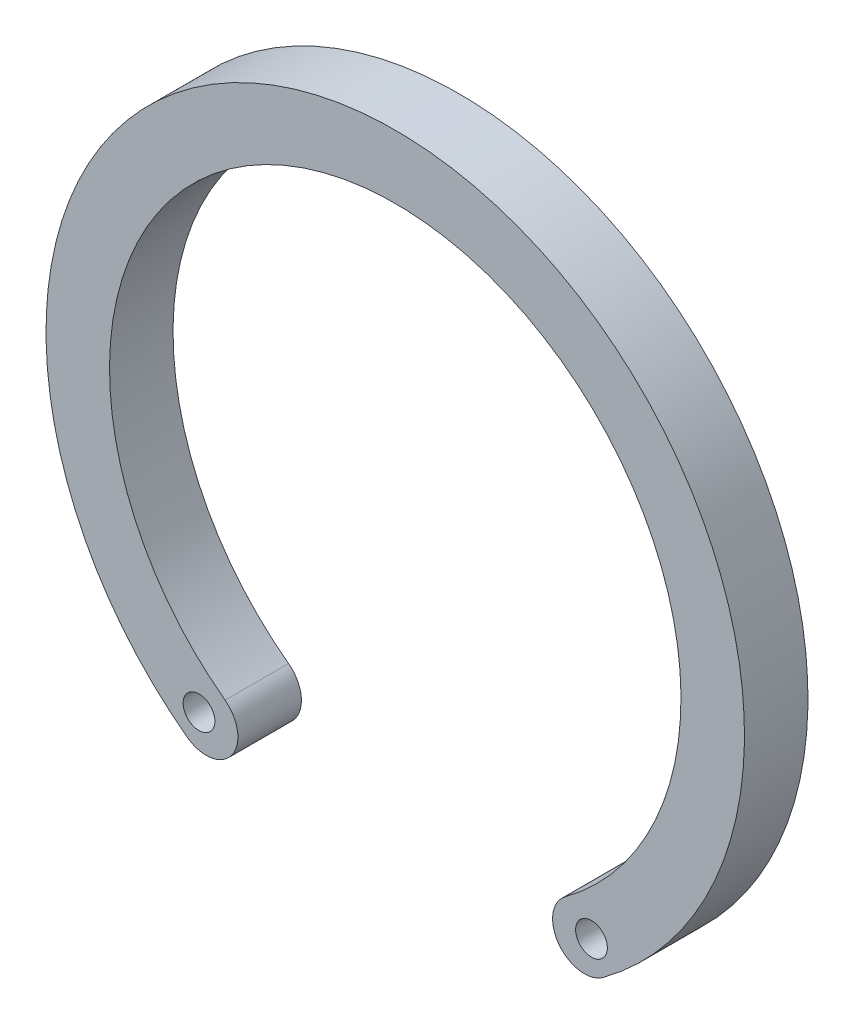
ISO-10303-21;
HEADER;
FILE_DESCRIPTION(('STEP AP214'),'2;1');
FILE_NAME('part.step','',(''),(''),'','','');
FILE_SCHEMA(('AUTOMOTIVE_DESIGN { 1 0 10303 214 1 1 1 1 }'));
ENDSEC;
DATA;
#1=APPLICATION_CONTEXT('core data for automotive mechanical design processes');
#2=APPLICATION_PROTOCOL_DEFINITION('international standard','automotive_design',2000,#1);
#3=PRODUCT_CONTEXT('',#1,'mechanical');
#4=PRODUCT('Part','Part','',(#3));
#5=PRODUCT_RELATED_PRODUCT_CATEGORY('part','',(#4));
#6=PRODUCT_DEFINITION_FORMATION('','',#4);
#7=PRODUCT_DEFINITION_CONTEXT('part definition',#1,'design');
#8=PRODUCT_DEFINITION('design','',#6,#7);
#9=PRODUCT_DEFINITION_SHAPE('','',#8);
#10=(LENGTH_UNIT() NAMED_UNIT(*) SI_UNIT(.MILLI.,.METRE.));
#11=(NAMED_UNIT(*) PLANE_ANGLE_UNIT() SI_UNIT($,.RADIAN.));
#12=(NAMED_UNIT(*) SI_UNIT($,.STERADIAN.) SOLID_ANGLE_UNIT());
#13=UNCERTAINTY_MEASURE_WITH_UNIT(LENGTH_MEASURE(1.E-05),#10,'distance_accuracy_value','');
#14=(GEOMETRIC_REPRESENTATION_CONTEXT(3) GLOBAL_UNCERTAINTY_ASSIGNED_CONTEXT((#13)) GLOBAL_UNIT_ASSIGNED_CONTEXT((#10,
#11,#12)) REPRESENTATION_CONTEXT('',''));
#15=CARTESIAN_POINT('',(0.,0.,0.));
#16=DIRECTION('',(0.,0.,1.));
#17=DIRECTION('',(1.,0.,0.));
#18=AXIS2_PLACEMENT_3D('',#15,#16,#17);
#19=CARTESIAN_POINT('',(-2.97779363616322,-4.01655885808062,1.));
#20=DIRECTION('',(0.,0.,-1.));
#21=DIRECTION('',(-1.,0.,0.));
#22=AXIS2_PLACEMENT_3D('',#19,#20,#21);
#23=CYLINDRICAL_SURFACE('',#22,0.5);
#24=CARTESIAN_POINT('',(-2.97779363616322,-4.01655885808062,0.));
#25=DIRECTION('',(0.,0.,1.));
#26=DIRECTION('',(1.,0.,0.));
#27=AXIS2_PLACEMENT_3D('',#24,#25,#26);
#28=CIRCLE('',#27,0.5);
#29=CARTESIAN_POINT('',(-3.27557299977954,-4.41821474388867,0.));
#30=VERTEX_POINT('',#29);
#31=CARTESIAN_POINT('',(-2.6800142725469,-3.61490297227255,0.));
#32=VERTEX_POINT('',#31);
#33=EDGE_CURVE('E95',#30,#32,#28,.T.);
#34=ORIENTED_EDGE('',*,*,#33,.T.);
#35=DIRECTION('',(0.,0.,-1.));
#36=VECTOR('',#35,1.);
#37=CARTESIAN_POINT('',(-2.6800142725469,-3.61490297227255,1.));
#38=LINE('',#37,#36);
#39=CARTESIAN_POINT('',(-2.6800142725469,-3.61490297227255,1.));
#40=VERTEX_POINT('',#39);
#41=EDGE_CURVE('E11',#40,#32,#38,.T.);
#42=ORIENTED_EDGE('',*,*,#41,.F.);
#43=CARTESIAN_POINT('',(-2.97779363616322,-4.01655885808062,1.));
#44=DIRECTION('',(0.,0.,1.));
#45=DIRECTION('',(1.,0.,0.));
#46=AXIS2_PLACEMENT_3D('',#43,#44,#45);
#47=CIRCLE('',#46,0.5);
#48=CARTESIAN_POINT('',(-3.27557299977954,-4.41821474388867,1.));
#49=VERTEX_POINT('',#48);
#50=EDGE_CURVE('E83',#49,#40,#47,.T.);
#51=ORIENTED_EDGE('',*,*,#50,.F.);
#52=DIRECTION('',(0.,0.,-1.));
#53=VECTOR('',#52,1.);
#54=CARTESIAN_POINT('',(-3.27557299977954,-4.41821474388867,1.));
#55=LINE('',#54,#53);
#56=EDGE_CURVE('E91',#49,#30,#55,.T.);
#57=ORIENTED_EDGE('',*,*,#56,.T.);
#58=EDGE_LOOP('',(#34,#42,#51,#57));
#59=FACE_BOUND('',#58,.T.);
#60=ADVANCED_FACE('F32',(#59),#23,.T.);
#61=CARTESIAN_POINT('',(0.,0.,1.));
#62=DIRECTION('',(0.,0.,-1.));
#63=DIRECTION('',(-1.,0.,0.));
#64=AXIS2_PLACEMENT_3D('',#61,#62,#63);
#65=CYLINDRICAL_SURFACE('',#64,4.5);
#66=CARTESIAN_POINT('',(0.,0.,0.));
#67=DIRECTION('',(0.,0.,-1.));
#68=DIRECTION('',(1.,0.,0.));
#69=AXIS2_PLACEMENT_3D('',#66,#67,#68);
#70=CIRCLE('',#69,4.5);
#71=CARTESIAN_POINT('',(2.68001427254689,-3.61490297227255,0.));
#72=VERTEX_POINT('',#71);
#73=EDGE_CURVE('E87',#32,#72,#70,.T.);
#74=ORIENTED_EDGE('',*,*,#73,.T.);
#75=DIRECTION('',(0.,0.,-1.));
#76=VECTOR('',#75,1.);
#77=CARTESIAN_POINT('',(2.68001427254689,-3.61490297227255,1.));
#78=LINE('',#77,#76);
#79=CARTESIAN_POINT('',(2.68001427254689,-3.61490297227255,1.));
#80=VERTEX_POINT('',#79);
#81=EDGE_CURVE('E40',#80,#72,#78,.T.);
#82=ORIENTED_EDGE('',*,*,#81,.F.);
#83=CARTESIAN_POINT('',(0.,0.,1.));
#84=DIRECTION('',(0.,0.,-1.));
#85=DIRECTION('',(1.,0.,0.));
#86=AXIS2_PLACEMENT_3D('',#83,#84,#85);
#87=CIRCLE('',#86,4.5);
#88=EDGE_CURVE('E78',#40,#80,#87,.T.);
#89=ORIENTED_EDGE('',*,*,#88,.F.);
#90=ORIENTED_EDGE('',*,*,#41,.T.);
#91=EDGE_LOOP('',(#74,#82,#89,#90));
#92=FACE_BOUND('',#91,.T.);
#93=ADVANCED_FACE('F86',(#92),#65,.F.);
#94=CARTESIAN_POINT('',(2.97779363616322,-4.01655885808061,1.));
#95=DIRECTION('',(0.,0.,-1.));
#96=DIRECTION('',(-1.,0.,0.));
#97=AXIS2_PLACEMENT_3D('',#94,#95,#96);
#98=CYLINDRICAL_SURFACE('',#97,0.499999999999999);
#99=CARTESIAN_POINT('',(2.97779363616322,-4.01655885808061,0.));
#100=DIRECTION('',(0.,0.,1.));
#101=DIRECTION('',(-1.,0.,0.));
#102=AXIS2_PLACEMENT_3D('',#99,#100,#101);
#103=CIRCLE('',#102,0.499999999999999);
#104=CARTESIAN_POINT('',(3.27557299977954,-4.41821474388867,0.));
#105=VERTEX_POINT('',#104);
#106=EDGE_CURVE('E65',#72,#105,#103,.T.);
#107=ORIENTED_EDGE('',*,*,#106,.T.);
#108=DIRECTION('',(0.,0.,-1.));
#109=VECTOR('',#108,1.);
#110=CARTESIAN_POINT('',(3.27557299977954,-4.41821474388867,1.));
#111=LINE('',#110,#109);
#112=CARTESIAN_POINT('',(3.27557299977954,-4.41821474388867,1.));
#113=VERTEX_POINT('',#112);
#114=EDGE_CURVE('E88',#113,#105,#111,.T.);
#115=ORIENTED_EDGE('',*,*,#114,.F.);
#116=CARTESIAN_POINT('',(2.97779363616322,-4.01655885808061,1.));
#117=DIRECTION('',(0.,0.,1.));
#118=DIRECTION('',(-1.,0.,0.));
#119=AXIS2_PLACEMENT_3D('',#116,#117,#118);
#120=CIRCLE('',#119,0.499999999999999);
#121=EDGE_CURVE('E81',#80,#113,#120,.T.);
#122=ORIENTED_EDGE('',*,*,#121,.F.);
#123=ORIENTED_EDGE('',*,*,#81,.T.);
#124=EDGE_LOOP('',(#107,#115,#122,#123));
#125=FACE_BOUND('',#124,.T.);
#126=ADVANCED_FACE('F89',(#125),#98,.T.);
#127=CARTESIAN_POINT('',(0.,0.,1.));
#128=DIRECTION('',(0.,0.,-1.));
#129=DIRECTION('',(-1.,0.,0.));
#130=AXIS2_PLACEMENT_3D('',#127,#128,#129);
#131=CYLINDRICAL_SURFACE('',#130,5.5);
#132=CARTESIAN_POINT('',(0.,0.,0.));
#133=DIRECTION('',(0.,0.,1.));
#134=DIRECTION('',(1.,0.,0.));
#135=AXIS2_PLACEMENT_3D('',#132,#133,#134);
#136=CIRCLE('',#135,5.5);
#137=EDGE_CURVE('E71',#105,#30,#136,.T.);
#138=ORIENTED_EDGE('',*,*,#137,.T.);
#139=ORIENTED_EDGE('',*,*,#56,.F.);
#140=CARTESIAN_POINT('',(0.,0.,1.));
#141=DIRECTION('',(0.,0.,1.));
#142=DIRECTION('',(1.,0.,0.));
#143=AXIS2_PLACEMENT_3D('',#140,#141,#142);
#144=CIRCLE('',#143,5.5);
#145=EDGE_CURVE('E48',#113,#49,#144,.T.);
#146=ORIENTED_EDGE('',*,*,#145,.F.);
#147=ORIENTED_EDGE('',*,*,#114,.T.);
#148=EDGE_LOOP('',(#138,#139,#146,#147));
#149=FACE_BOUND('',#148,.T.);
#150=ADVANCED_FACE('F103',(#149),#131,.T.);
#151=CARTESIAN_POINT('',(-1.48889681808161,-2.00827942904031,1.));
#152=DIRECTION('',(0.,0.,1.));
#153=DIRECTION('',(1.,0.,0.));
#154=AXIS2_PLACEMENT_3D('',#151,#152,#153);
#155=PLANE('',#154);
#156=CARTESIAN_POINT('',(-3.09053888875894,-3.98423230241532,1.));
#157=DIRECTION('',(0.,0.,1.));
#158=DIRECTION('',(1.,0.,0.));
#159=AXIS2_PLACEMENT_3D('',#156,#157,#158);
#160=CIRCLE('',#159,0.25);
#161=CARTESIAN_POINT('',(-2.84053888875894,-3.98423230241532,1.));
#162=VERTEX_POINT('',#161);
#163=EDGE_CURVE('E115',#162,#162,#160,.T.);
#164=ORIENTED_EDGE('',*,*,#163,.F.);
#165=EDGE_LOOP('',(#164));
#166=FACE_BOUND('',#165,.T.);
#167=CARTESIAN_POINT('',(3.09053888875894,-3.98423230241532,1.));
#168=DIRECTION('',(0.,0.,1.));
#169=DIRECTION('',(-1.,0.,0.));
#170=AXIS2_PLACEMENT_3D('',#167,#168,#169);
#171=CIRCLE('',#170,0.25);
#172=CARTESIAN_POINT('',(2.84053888875894,-3.98423230241532,1.));
#173=VERTEX_POINT('',#172);
#174=EDGE_CURVE('E109',#173,#173,#171,.T.);
#175=ORIENTED_EDGE('',*,*,#174,.F.);
#176=EDGE_LOOP('',(#175));
#177=FACE_BOUND('',#176,.T.);
#178=ORIENTED_EDGE('',*,*,#50,.T.);
#179=ORIENTED_EDGE('',*,*,#88,.T.);
#180=ORIENTED_EDGE('',*,*,#121,.T.);
#181=ORIENTED_EDGE('',*,*,#145,.T.);
#182=EDGE_LOOP('',(#178,#179,#180,#181));
#183=FACE_BOUND('',#182,.T.);
#184=ADVANCED_FACE('F79',(#166,#177,#183),#155,.T.);
#185=CARTESIAN_POINT('',(-1.48889681808161,-2.00827942904031,0.));
#186=DIRECTION('',(0.,0.,1.));
#187=DIRECTION('',(1.,0.,0.));
#188=AXIS2_PLACEMENT_3D('',#185,#186,#187);
#189=PLANE('',#188);
#190=CARTESIAN_POINT('',(-3.09053888875894,-3.98423230241532,0.));
#191=DIRECTION('',(0.,0.,1.));
#192=DIRECTION('',(1.,0.,0.));
#193=AXIS2_PLACEMENT_3D('',#190,#191,#192);
#194=CIRCLE('',#193,0.25);
#195=CARTESIAN_POINT('',(-2.84053888875894,-3.98423230241532,0.));
#196=VERTEX_POINT('',#195);
#197=EDGE_CURVE('E98',#196,#196,#194,.T.);
#198=ORIENTED_EDGE('',*,*,#197,.T.);
#199=EDGE_LOOP('',(#198));
#200=FACE_BOUND('',#199,.T.);
#201=CARTESIAN_POINT('',(3.09053888875894,-3.98423230241532,0.));
#202=DIRECTION('',(0.,0.,1.));
#203=DIRECTION('',(-1.,0.,0.));
#204=AXIS2_PLACEMENT_3D('',#201,#202,#203);
#205=CIRCLE('',#204,0.25);
#206=CARTESIAN_POINT('',(2.84053888875894,-3.98423230241532,0.));
#207=VERTEX_POINT('',#206);
#208=EDGE_CURVE('E112',#207,#207,#205,.T.);
#209=ORIENTED_EDGE('',*,*,#208,.T.);
#210=EDGE_LOOP('',(#209));
#211=FACE_BOUND('',#210,.T.);
#212=ORIENTED_EDGE('',*,*,#33,.F.);
#213=ORIENTED_EDGE('',*,*,#137,.F.);
#214=ORIENTED_EDGE('',*,*,#106,.F.);
#215=ORIENTED_EDGE('',*,*,#73,.F.);
#216=EDGE_LOOP('',(#212,#213,#214,#215));
#217=FACE_BOUND('',#216,.T.);
#218=ADVANCED_FACE('F106',(#200,#211,#217),#189,.F.);
#219=CARTESIAN_POINT('',(3.09053888875894,-3.98423230241532,0.));
#220=DIRECTION('',(0.,0.,1.));
#221=DIRECTION('',(1.,0.,0.));
#222=AXIS2_PLACEMENT_3D('',#219,#220,#221);
#223=CYLINDRICAL_SURFACE('',#222,0.25);
#224=ORIENTED_EDGE('',*,*,#208,.F.);
#225=EDGE_LOOP('',(#224));
#226=FACE_BOUND('',#225,.T.);
#227=ORIENTED_EDGE('',*,*,#174,.T.);
#228=EDGE_LOOP('',(#227));
#229=FACE_BOUND('',#228,.T.);
#230=ADVANCED_FACE('F126',(#226,#229),#223,.F.);
#231=CARTESIAN_POINT('',(-3.09053888875894,-3.98423230241532,0.));
#232=DIRECTION('',(0.,0.,1.));
#233=DIRECTION('',(1.,0.,0.));
#234=AXIS2_PLACEMENT_3D('',#231,#232,#233);
#235=CYLINDRICAL_SURFACE('',#234,0.25);
#236=ORIENTED_EDGE('',*,*,#197,.F.);
#237=EDGE_LOOP('',(#236));
#238=FACE_BOUND('',#237,.T.);
#239=ORIENTED_EDGE('',*,*,#163,.T.);
#240=EDGE_LOOP('',(#239));
#241=FACE_BOUND('',#240,.T.);
#242=ADVANCED_FACE('F123',(#238,#241),#235,.F.);
#243=CLOSED_SHELL('',(#60,#93,#126,#150,#184,#218,#230,#242));
#244=MANIFOLD_SOLID_BREP('B2',#243);
#245=ADVANCED_BREP_SHAPE_REPRESENTATION('',(#18,#244),#14);
#246=SHAPE_DEFINITION_REPRESENTATION(#9,#245);
ENDSEC;
END-ISO-10303-21;
